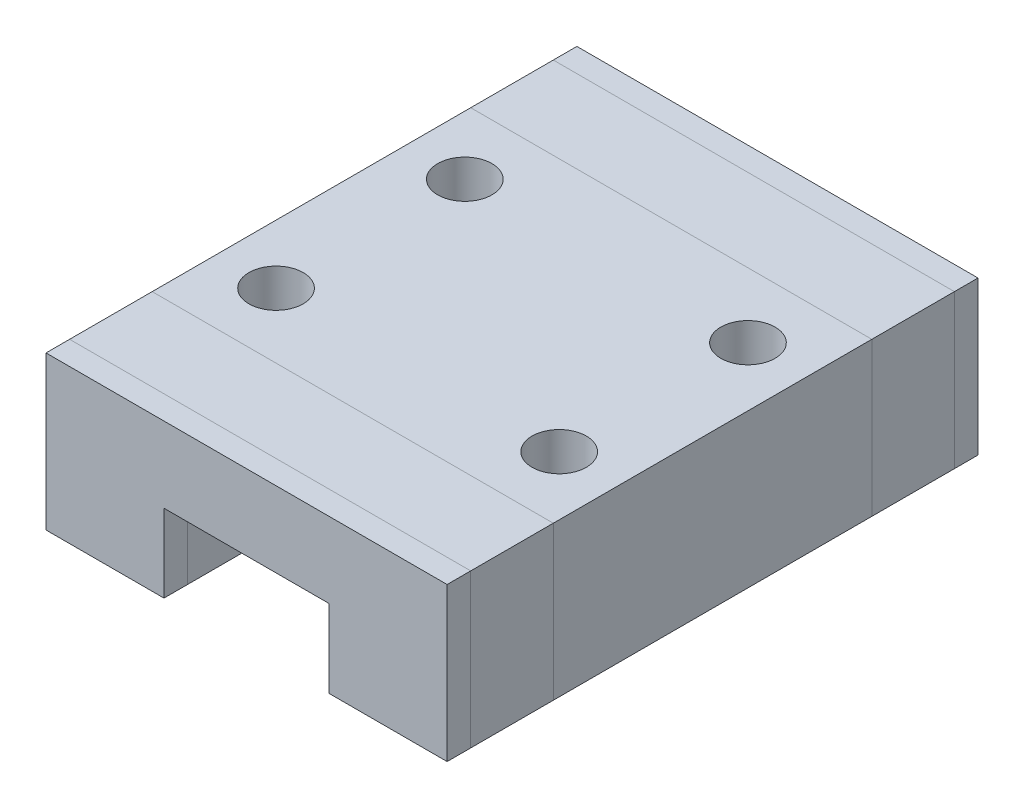
ISO-10303-21;
HEADER;
FILE_DESCRIPTION(('STEP AP214'),'2;1');
FILE_NAME('part.step','',(''),(''),'','','');
FILE_SCHEMA(('AUTOMOTIVE_DESIGN { 1 0 10303 214 1 1 1 1 }'));
ENDSEC;
DATA;
#1=APPLICATION_CONTEXT('core data for automotive mechanical design processes');
#2=APPLICATION_PROTOCOL_DEFINITION('international standard','automotive_design',2000,#1);
#3=PRODUCT_CONTEXT('',#1,'mechanical');
#4=PRODUCT('Part','Part','',(#3));
#5=PRODUCT_RELATED_PRODUCT_CATEGORY('part','',(#4));
#6=PRODUCT_DEFINITION_FORMATION('','',#4);
#7=PRODUCT_DEFINITION_CONTEXT('part definition',#1,'design');
#8=PRODUCT_DEFINITION('design','',#6,#7);
#9=PRODUCT_DEFINITION_SHAPE('','',#8);
#10=(LENGTH_UNIT() NAMED_UNIT(*) SI_UNIT(.MILLI.,.METRE.));
#11=(NAMED_UNIT(*) PLANE_ANGLE_UNIT() SI_UNIT($,.RADIAN.));
#12=(NAMED_UNIT(*) SI_UNIT($,.STERADIAN.) SOLID_ANGLE_UNIT());
#13=UNCERTAINTY_MEASURE_WITH_UNIT(LENGTH_MEASURE(1.E-05),#10,'distance_accuracy_value','');
#14=(GEOMETRIC_REPRESENTATION_CONTEXT(3) GLOBAL_UNCERTAINTY_ASSIGNED_CONTEXT((#13)) GLOBAL_UNIT_ASSIGNED_CONTEXT((#10,
#11,#12)) REPRESENTATION_CONTEXT('',''));
#15=CARTESIAN_POINT('',(0.,0.,0.));
#16=DIRECTION('',(0.,0.,1.));
#17=DIRECTION('',(1.,0.,0.));
#18=AXIS2_PLACEMENT_3D('',#15,#16,#17);
#19=CARTESIAN_POINT('',(-8.5,-3.25,22.5));
#20=DIRECTION('',(0.,1.,0.));
#21=DIRECTION('',(0.,0.,1.));
#22=AXIS2_PLACEMENT_3D('',#19,#20,#21);
#23=PLANE('',#22);
#24=DIRECTION('',(-1.,0.,0.));
#25=VECTOR('',#24,1.);
#26=CARTESIAN_POINT('',(-8.5,-3.25,4.5));
#27=LINE('',#26,#25);
#28=CARTESIAN_POINT('',(-3.5,-3.25,4.5));
#29=VERTEX_POINT('',#28);
#30=CARTESIAN_POINT('',(-8.5,-3.25,4.50000000000001));
#31=VERTEX_POINT('',#30);
#32=EDGE_CURVE('E11',#29,#31,#27,.T.);
#33=ORIENTED_EDGE('',*,*,#32,.F.);
#34=DIRECTION('',(0.,0.,1.));
#35=VECTOR('',#34,1.);
#36=CARTESIAN_POINT('',(-3.5,-3.25,0.));
#37=LINE('',#36,#35);
#38=CARTESIAN_POINT('',(-3.5,-3.25,18.));
#39=VERTEX_POINT('',#38);
#40=EDGE_CURVE('E447',#29,#39,#37,.T.);
#41=ORIENTED_EDGE('',*,*,#40,.T.);
#42=DIRECTION('',(-1.,0.,0.));
#43=VECTOR('',#42,1.);
#44=CARTESIAN_POINT('',(-8.5,-3.25,18.));
#45=LINE('',#44,#43);
#46=CARTESIAN_POINT('',(-8.5,-3.25,18.));
#47=VERTEX_POINT('',#46);
#48=EDGE_CURVE('E269',#39,#47,#45,.T.);
#49=ORIENTED_EDGE('',*,*,#48,.T.);
#50=DIRECTION('',(0.,0.,-1.));
#51=VECTOR('',#50,1.);
#52=CARTESIAN_POINT('',(-8.5,-3.25,22.5));
#53=LINE('',#52,#51);
#54=EDGE_CURVE('E258',#47,#31,#53,.T.);
#55=ORIENTED_EDGE('',*,*,#54,.T.);
#56=EDGE_LOOP('',(#33,#41,#49,#55));
#57=FACE_BOUND('',#56,.T.);
#58=ADVANCED_FACE('F38',(#57),#23,.F.);
#59=CARTESIAN_POINT('',(8.5,-3.25,22.5));
#60=DIRECTION('',(-1.,0.,0.));
#61=DIRECTION('',(0.,0.,1.));
#62=AXIS2_PLACEMENT_3D('',#59,#60,#61);
#63=PLANE('',#62);
#64=DIRECTION('',(0.,-1.,0.));
#65=VECTOR('',#64,1.);
#66=CARTESIAN_POINT('',(8.5,-3.25,4.5));
#67=LINE('',#66,#65);
#68=CARTESIAN_POINT('',(8.5,3.25,4.50000000000001));
#69=VERTEX_POINT('',#68);
#70=CARTESIAN_POINT('',(8.5,-3.25,4.50000000000001));
#71=VERTEX_POINT('',#70);
#72=EDGE_CURVE('E48',#69,#71,#67,.T.);
#73=ORIENTED_EDGE('',*,*,#72,.F.);
#74=DIRECTION('',(0.,0.,-1.));
#75=VECTOR('',#74,1.);
#76=CARTESIAN_POINT('',(8.5,3.25,22.5));
#77=LINE('',#76,#75);
#78=CARTESIAN_POINT('',(8.5,3.25,18.));
#79=VERTEX_POINT('',#78);
#80=EDGE_CURVE('E272',#79,#69,#77,.T.);
#81=ORIENTED_EDGE('',*,*,#80,.F.);
#82=DIRECTION('',(0.,-1.,0.));
#83=VECTOR('',#82,1.);
#84=CARTESIAN_POINT('',(8.5,-3.25,18.));
#85=LINE('',#84,#83);
#86=CARTESIAN_POINT('',(8.5,-3.25,18.));
#87=VERTEX_POINT('',#86);
#88=EDGE_CURVE('E273',#79,#87,#85,.T.);
#89=ORIENTED_EDGE('',*,*,#88,.T.);
#90=DIRECTION('',(0.,0.,-1.));
#91=VECTOR('',#90,1.);
#92=CARTESIAN_POINT('',(8.5,-3.25,22.5));
#93=LINE('',#92,#91);
#94=EDGE_CURVE('E251',#87,#71,#93,.T.);
#95=ORIENTED_EDGE('',*,*,#94,.T.);
#96=EDGE_LOOP('',(#73,#81,#89,#95));
#97=FACE_BOUND('',#96,.T.);
#98=ADVANCED_FACE('F539',(#97),#63,.F.);
#99=CARTESIAN_POINT('',(-8.5,3.25,22.5));
#100=DIRECTION('',(0.,-1.,0.));
#101=DIRECTION('',(0.,0.,-1.));
#102=AXIS2_PLACEMENT_3D('',#99,#100,#101);
#103=PLANE('',#102);
#104=CARTESIAN_POINT('',(6.,3.25,7.25));
#105=DIRECTION('',(0.,1.,0.));
#106=DIRECTION('',(0.,0.,-1.));
#107=AXIS2_PLACEMENT_3D('',#104,#105,#106);
#108=CIRCLE('',#107,1.15);
#109=CARTESIAN_POINT('',(6.,3.25,6.1));
#110=VERTEX_POINT('',#109);
#111=EDGE_CURVE('E508',#110,#110,#108,.T.);
#112=ORIENTED_EDGE('',*,*,#111,.F.);
#113=EDGE_LOOP('',(#112));
#114=FACE_BOUND('',#113,.T.);
#115=CARTESIAN_POINT('',(6.,3.25,15.25));
#116=DIRECTION('',(0.,1.,0.));
#117=DIRECTION('',(0.,0.,1.));
#118=AXIS2_PLACEMENT_3D('',#115,#116,#117);
#119=CIRCLE('',#118,1.15);
#120=CARTESIAN_POINT('',(6.,3.25,16.4));
#121=VERTEX_POINT('',#120);
#122=EDGE_CURVE('E514',#121,#121,#119,.T.);
#123=ORIENTED_EDGE('',*,*,#122,.F.);
#124=EDGE_LOOP('',(#123));
#125=FACE_BOUND('',#124,.T.);
#126=CARTESIAN_POINT('',(-6.,3.25,15.25));
#127=DIRECTION('',(0.,1.,0.));
#128=DIRECTION('',(0.,0.,-1.));
#129=AXIS2_PLACEMENT_3D('',#126,#127,#128);
#130=CIRCLE('',#129,1.15);
#131=CARTESIAN_POINT('',(-6.,3.25,14.1));
#132=VERTEX_POINT('',#131);
#133=EDGE_CURVE('E520',#132,#132,#130,.T.);
#134=ORIENTED_EDGE('',*,*,#133,.F.);
#135=EDGE_LOOP('',(#134));
#136=FACE_BOUND('',#135,.T.);
#137=CARTESIAN_POINT('',(-6.,3.25,7.25));
#138=DIRECTION('',(0.,1.,0.));
#139=DIRECTION('',(0.,0.,1.));
#140=AXIS2_PLACEMENT_3D('',#137,#138,#139);
#141=CIRCLE('',#140,1.15);
#142=CARTESIAN_POINT('',(-6.,3.25,8.4));
#143=VERTEX_POINT('',#142);
#144=EDGE_CURVE('E502',#143,#143,#141,.T.);
#145=ORIENTED_EDGE('',*,*,#144,.F.);
#146=EDGE_LOOP('',(#145));
#147=FACE_BOUND('',#146,.T.);
#148=DIRECTION('',(1.,0.,0.));
#149=VECTOR('',#148,1.);
#150=CARTESIAN_POINT('',(-8.5,3.25,4.5));
#151=LINE('',#150,#149);
#152=CARTESIAN_POINT('',(-8.5,3.25,4.50000000000001));
#153=VERTEX_POINT('',#152);
#154=EDGE_CURVE('E62',#153,#69,#151,.T.);
#155=ORIENTED_EDGE('',*,*,#154,.F.);
#156=DIRECTION('',(0.,0.,-1.));
#157=VECTOR('',#156,1.);
#158=CARTESIAN_POINT('',(-8.5,3.25,22.5));
#159=LINE('',#158,#157);
#160=CARTESIAN_POINT('',(-8.5,3.25,18.));
#161=VERTEX_POINT('',#160);
#162=EDGE_CURVE('E265',#161,#153,#159,.T.);
#163=ORIENTED_EDGE('',*,*,#162,.F.);
#164=DIRECTION('',(1.,0.,0.));
#165=VECTOR('',#164,1.);
#166=CARTESIAN_POINT('',(-8.5,3.25,18.));
#167=LINE('',#166,#165);
#168=EDGE_CURVE('E278',#161,#79,#167,.T.);
#169=ORIENTED_EDGE('',*,*,#168,.T.);
#170=ORIENTED_EDGE('',*,*,#80,.T.);
#171=EDGE_LOOP('',(#155,#163,#169,#170));
#172=FACE_BOUND('',#171,.T.);
#173=ADVANCED_FACE('F535',(#114,#125,#136,#147,#172),#103,.F.);
#174=CARTESIAN_POINT('',(-8.5,-3.25,22.5));
#175=DIRECTION('',(1.,0.,0.));
#176=DIRECTION('',(0.,0.,-1.));
#177=AXIS2_PLACEMENT_3D('',#174,#175,#176);
#178=PLANE('',#177);
#179=DIRECTION('',(0.,1.,0.));
#180=VECTOR('',#179,1.);
#181=CARTESIAN_POINT('',(-8.5,-3.25,4.5));
#182=LINE('',#181,#180);
#183=EDGE_CURVE('E360',#31,#153,#182,.T.);
#184=ORIENTED_EDGE('',*,*,#183,.F.);
#185=ORIENTED_EDGE('',*,*,#54,.F.);
#186=DIRECTION('',(0.,1.,0.));
#187=VECTOR('',#186,1.);
#188=CARTESIAN_POINT('',(-8.5,-3.25,18.));
#189=LINE('',#188,#187);
#190=EDGE_CURVE('E277',#47,#161,#189,.T.);
#191=ORIENTED_EDGE('',*,*,#190,.T.);
#192=ORIENTED_EDGE('',*,*,#162,.T.);
#193=EDGE_LOOP('',(#184,#185,#191,#192));
#194=FACE_BOUND('',#193,.T.);
#195=ADVANCED_FACE('F538',(#194),#178,.F.);
#196=DIRECTION('',(-1.,0.,0.));
#197=VECTOR('',#196,1.);
#198=CARTESIAN_POINT('',(-8.5,-3.25,4.5));
#199=LINE('',#198,#197);
#200=CARTESIAN_POINT('',(3.5,-3.25,4.5));
#201=VERTEX_POINT('',#200);
#202=EDGE_CURVE('E363',#71,#201,#199,.T.);
#203=ORIENTED_EDGE('',*,*,#202,.F.);
#204=ORIENTED_EDGE('',*,*,#94,.F.);
#205=DIRECTION('',(-1.,0.,0.));
#206=VECTOR('',#205,1.);
#207=CARTESIAN_POINT('',(-8.5,-3.25,18.));
#208=LINE('',#207,#206);
#209=CARTESIAN_POINT('',(3.5,-3.25,18.));
#210=VERTEX_POINT('',#209);
#211=EDGE_CURVE('E286',#87,#210,#208,.T.);
#212=ORIENTED_EDGE('',*,*,#211,.T.);
#213=DIRECTION('',(0.,0.,1.));
#214=VECTOR('',#213,1.);
#215=CARTESIAN_POINT('',(3.5,-3.25,0.));
#216=LINE('',#215,#214);
#217=EDGE_CURVE('E228',#201,#210,#216,.T.);
#218=ORIENTED_EDGE('',*,*,#217,.F.);
#219=EDGE_LOOP('',(#203,#204,#212,#218));
#220=FACE_BOUND('',#219,.T.);
#221=ADVANCED_FACE('F562',(#220),#23,.F.);
#222=CARTESIAN_POINT('',(-3.5,-3.25,0.));
#223=DIRECTION('',(-1.,0.,0.));
#224=DIRECTION('',(0.,0.,1.));
#225=AXIS2_PLACEMENT_3D('',#222,#223,#224);
#226=PLANE('',#225);
#227=DIRECTION('',(0.,-1.,0.));
#228=VECTOR('',#227,1.);
#229=CARTESIAN_POINT('',(-3.5,-3.25,4.5));
#230=LINE('',#229,#228);
#231=CARTESIAN_POINT('',(-3.5,0.0500000000000001,4.5));
#232=VERTEX_POINT('',#231);
#233=EDGE_CURVE('E370',#232,#29,#230,.T.);
#234=ORIENTED_EDGE('',*,*,#233,.F.);
#235=DIRECTION('',(0.,0.,1.));
#236=VECTOR('',#235,1.);
#237=CARTESIAN_POINT('',(-3.5,0.0500000000000001,0.));
#238=LINE('',#237,#236);
#239=CARTESIAN_POINT('',(-3.5,0.0500000000000001,18.));
#240=VERTEX_POINT('',#239);
#241=EDGE_CURVE('E453',#232,#240,#238,.T.);
#242=ORIENTED_EDGE('',*,*,#241,.T.);
#243=DIRECTION('',(0.,-1.,0.));
#244=VECTOR('',#243,1.);
#245=CARTESIAN_POINT('',(-3.5,-3.25,18.));
#246=LINE('',#245,#244);
#247=EDGE_CURVE('E282',#240,#39,#246,.T.);
#248=ORIENTED_EDGE('',*,*,#247,.T.);
#249=ORIENTED_EDGE('',*,*,#40,.F.);
#250=EDGE_LOOP('',(#234,#242,#248,#249));
#251=FACE_BOUND('',#250,.T.);
#252=ADVANCED_FACE('F570',(#251),#226,.F.);
#253=CARTESIAN_POINT('',(-3.5,0.0500000000000001,0.));
#254=DIRECTION('',(0.,1.,0.));
#255=DIRECTION('',(-1.,0.,0.));
#256=AXIS2_PLACEMENT_3D('',#253,#254,#255);
#257=PLANE('',#256);
#258=DIRECTION('',(-1.,0.,0.));
#259=VECTOR('',#258,1.);
#260=CARTESIAN_POINT('',(-3.5,0.0500000000000001,4.5));
#261=LINE('',#260,#259);
#262=CARTESIAN_POINT('',(3.5,0.050000000000001,4.5));
#263=VERTEX_POINT('',#262);
#264=EDGE_CURVE('E373',#263,#232,#261,.T.);
#265=ORIENTED_EDGE('',*,*,#264,.F.);
#266=DIRECTION('',(0.,0.,1.));
#267=VECTOR('',#266,1.);
#268=CARTESIAN_POINT('',(3.5,0.050000000000001,0.));
#269=LINE('',#268,#267);
#270=CARTESIAN_POINT('',(3.5,0.050000000000001,18.));
#271=VERTEX_POINT('',#270);
#272=EDGE_CURVE('E396',#263,#271,#269,.T.);
#273=ORIENTED_EDGE('',*,*,#272,.T.);
#274=DIRECTION('',(-1.,0.,0.));
#275=VECTOR('',#274,1.);
#276=CARTESIAN_POINT('',(-3.5,0.0500000000000001,18.));
#277=LINE('',#276,#275);
#278=EDGE_CURVE('E295',#271,#240,#277,.T.);
#279=ORIENTED_EDGE('',*,*,#278,.T.);
#280=ORIENTED_EDGE('',*,*,#241,.F.);
#281=EDGE_LOOP('',(#265,#273,#279,#280));
#282=FACE_BOUND('',#281,.T.);
#283=ADVANCED_FACE('F627',(#282),#257,.F.);
#284=CARTESIAN_POINT('',(3.5,0.050000000000001,0.));
#285=DIRECTION('',(1.,0.,0.));
#286=DIRECTION('',(0.,1.,0.));
#287=AXIS2_PLACEMENT_3D('',#284,#285,#286);
#288=PLANE('',#287);
#289=DIRECTION('',(0.,1.,0.));
#290=VECTOR('',#289,1.);
#291=CARTESIAN_POINT('',(3.5,0.050000000000001,4.5));
#292=LINE('',#291,#290);
#293=EDGE_CURVE('E42',#201,#263,#292,.T.);
#294=ORIENTED_EDGE('',*,*,#293,.F.);
#295=ORIENTED_EDGE('',*,*,#217,.T.);
#296=DIRECTION('',(0.,1.,0.));
#297=VECTOR('',#296,1.);
#298=CARTESIAN_POINT('',(3.5,0.050000000000001,18.));
#299=LINE('',#298,#297);
#300=EDGE_CURVE('E290',#210,#271,#299,.T.);
#301=ORIENTED_EDGE('',*,*,#300,.T.);
#302=ORIENTED_EDGE('',*,*,#272,.F.);
#303=EDGE_LOOP('',(#294,#295,#301,#302));
#304=FACE_BOUND('',#303,.T.);
#305=ADVANCED_FACE('F397',(#304),#288,.F.);
#306=CARTESIAN_POINT('',(-3.5,-3.25,1.));
#307=VERTEX_POINT('',#306);
#308=EDGE_CURVE('E446',#307,#29,#37,.T.);
#309=ORIENTED_EDGE('',*,*,#308,.T.);
#310=ORIENTED_EDGE('',*,*,#32,.T.);
#311=CARTESIAN_POINT('',(-8.5,-3.25,1.00000000000001));
#312=VERTEX_POINT('',#311);
#313=EDGE_CURVE('E257',#31,#312,#53,.T.);
#314=ORIENTED_EDGE('',*,*,#313,.T.);
#315=DIRECTION('',(-1.,0.,0.));
#316=VECTOR('',#315,1.);
#317=CARTESIAN_POINT('',(-8.5,-3.25,1.));
#318=LINE('',#317,#316);
#319=EDGE_CURVE('E341',#307,#312,#318,.T.);
#320=ORIENTED_EDGE('',*,*,#319,.F.);
#321=EDGE_LOOP('',(#309,#310,#314,#320));
#322=FACE_BOUND('',#321,.T.);
#323=ADVANCED_FACE('F485',(#322),#23,.F.);
#324=CARTESIAN_POINT('',(8.5,3.25,1.00000000000001));
#325=VERTEX_POINT('',#324);
#326=EDGE_CURVE('E271',#69,#325,#77,.T.);
#327=ORIENTED_EDGE('',*,*,#326,.F.);
#328=ORIENTED_EDGE('',*,*,#72,.T.);
#329=CARTESIAN_POINT('',(8.5,-3.25,1.00000000000001));
#330=VERTEX_POINT('',#329);
#331=EDGE_CURVE('E250',#71,#330,#93,.T.);
#332=ORIENTED_EDGE('',*,*,#331,.T.);
#333=DIRECTION('',(0.,-1.,0.));
#334=VECTOR('',#333,1.);
#335=CARTESIAN_POINT('',(8.5,-3.25,1.));
#336=LINE('',#335,#334);
#337=EDGE_CURVE('E337',#325,#330,#336,.T.);
#338=ORIENTED_EDGE('',*,*,#337,.F.);
#339=EDGE_LOOP('',(#327,#328,#332,#338));
#340=FACE_BOUND('',#339,.T.);
#341=ADVANCED_FACE('F566',(#340),#63,.F.);
#342=CARTESIAN_POINT('',(-8.5,3.25,1.00000000000001));
#343=VERTEX_POINT('',#342);
#344=EDGE_CURVE('E264',#153,#343,#159,.T.);
#345=ORIENTED_EDGE('',*,*,#344,.F.);
#346=ORIENTED_EDGE('',*,*,#154,.T.);
#347=ORIENTED_EDGE('',*,*,#326,.T.);
#348=DIRECTION('',(1.,0.,0.));
#349=VECTOR('',#348,1.);
#350=CARTESIAN_POINT('',(-8.5,3.25,1.));
#351=LINE('',#350,#349);
#352=EDGE_CURVE('E336',#343,#325,#351,.T.);
#353=ORIENTED_EDGE('',*,*,#352,.F.);
#354=EDGE_LOOP('',(#345,#346,#347,#353));
#355=FACE_BOUND('',#354,.T.);
#356=ADVANCED_FACE('F541',(#355),#103,.F.);
#357=ORIENTED_EDGE('',*,*,#313,.F.);
#358=ORIENTED_EDGE('',*,*,#183,.T.);
#359=ORIENTED_EDGE('',*,*,#344,.T.);
#360=DIRECTION('',(0.,1.,0.));
#361=VECTOR('',#360,1.);
#362=CARTESIAN_POINT('',(-8.5,-3.25,1.));
#363=LINE('',#362,#361);
#364=EDGE_CURVE('E332',#312,#343,#363,.T.);
#365=ORIENTED_EDGE('',*,*,#364,.F.);
#366=EDGE_LOOP('',(#357,#358,#359,#365));
#367=FACE_BOUND('',#366,.T.);
#368=ADVANCED_FACE('F490',(#367),#178,.F.);
#369=ORIENTED_EDGE('',*,*,#331,.F.);
#370=ORIENTED_EDGE('',*,*,#202,.T.);
#371=CARTESIAN_POINT('',(3.5,-3.25,1.));
#372=VERTEX_POINT('',#371);
#373=EDGE_CURVE('E226',#372,#201,#216,.T.);
#374=ORIENTED_EDGE('',*,*,#373,.F.);
#375=DIRECTION('',(-1.,0.,0.));
#376=VECTOR('',#375,1.);
#377=CARTESIAN_POINT('',(-8.5,-3.25,1.));
#378=LINE('',#377,#376);
#379=EDGE_CURVE('E223',#330,#372,#378,.T.);
#380=ORIENTED_EDGE('',*,*,#379,.F.);
#381=EDGE_LOOP('',(#369,#370,#374,#380));
#382=FACE_BOUND('',#381,.T.);
#383=ADVANCED_FACE('F604',(#382),#23,.F.);
#384=CARTESIAN_POINT('',(-3.5,0.0500000000000001,1.));
#385=VERTEX_POINT('',#384);
#386=EDGE_CURVE('E452',#385,#232,#238,.T.);
#387=ORIENTED_EDGE('',*,*,#386,.T.);
#388=ORIENTED_EDGE('',*,*,#233,.T.);
#389=ORIENTED_EDGE('',*,*,#308,.F.);
#390=DIRECTION('',(0.,-1.,0.));
#391=VECTOR('',#390,1.);
#392=CARTESIAN_POINT('',(-3.5,-3.25,1.));
#393=LINE('',#392,#391);
#394=EDGE_CURVE('E350',#385,#307,#393,.T.);
#395=ORIENTED_EDGE('',*,*,#394,.F.);
#396=EDGE_LOOP('',(#387,#388,#389,#395));
#397=FACE_BOUND('',#396,.T.);
#398=ADVANCED_FACE('F612',(#397),#226,.F.);
#399=CARTESIAN_POINT('',(3.5,0.050000000000001,1.));
#400=VERTEX_POINT('',#399);
#401=EDGE_CURVE('E392',#400,#263,#269,.T.);
#402=ORIENTED_EDGE('',*,*,#401,.T.);
#403=ORIENTED_EDGE('',*,*,#264,.T.);
#404=ORIENTED_EDGE('',*,*,#386,.F.);
#405=DIRECTION('',(-1.,0.,0.));
#406=VECTOR('',#405,1.);
#407=CARTESIAN_POINT('',(-3.5,0.0500000000000001,1.));
#408=LINE('',#407,#406);
#409=EDGE_CURVE('E354',#400,#385,#408,.T.);
#410=ORIENTED_EDGE('',*,*,#409,.F.);
#411=EDGE_LOOP('',(#402,#403,#404,#410));
#412=FACE_BOUND('',#411,.T.);
#413=ADVANCED_FACE('F403',(#412),#257,.F.);
#414=ORIENTED_EDGE('',*,*,#373,.T.);
#415=ORIENTED_EDGE('',*,*,#293,.T.);
#416=ORIENTED_EDGE('',*,*,#401,.F.);
#417=DIRECTION('',(0.,1.,0.));
#418=VECTOR('',#417,1.);
#419=CARTESIAN_POINT('',(3.5,0.050000000000001,1.));
#420=LINE('',#419,#418);
#421=EDGE_CURVE('E323',#372,#400,#420,.T.);
#422=ORIENTED_EDGE('',*,*,#421,.F.);
#423=EDGE_LOOP('',(#414,#415,#416,#422));
#424=FACE_BOUND('',#423,.T.);
#425=ADVANCED_FACE('F391',(#424),#288,.F.);
#426=DIRECTION('',(0.,1.,0.));
#427=VECTOR('',#426,1.);
#428=CARTESIAN_POINT('',(3.5,0.050000000000001,21.5));
#429=LINE('',#428,#427);
#430=CARTESIAN_POINT('',(3.5,-3.25,21.5));
#431=VERTEX_POINT('',#430);
#432=CARTESIAN_POINT('',(3.5,0.050000000000001,21.5));
#433=VERTEX_POINT('',#432);
#434=EDGE_CURVE('E320',#431,#433,#429,.T.);
#435=ORIENTED_EDGE('',*,*,#434,.F.);
#436=CARTESIAN_POINT('',(3.5,-3.25,22.5));
#437=VERTEX_POINT('',#436);
#438=EDGE_CURVE('E430',#431,#437,#216,.T.);
#439=ORIENTED_EDGE('',*,*,#438,.T.);
#440=DIRECTION('',(0.,1.,0.));
#441=VECTOR('',#440,1.);
#442=CARTESIAN_POINT('',(3.5,0.050000000000001,22.5));
#443=LINE('',#442,#441);
#444=CARTESIAN_POINT('',(3.5,0.050000000000001,22.5));
#445=VERTEX_POINT('',#444);
#446=EDGE_CURVE('E427',#437,#445,#443,.T.);
#447=ORIENTED_EDGE('',*,*,#446,.T.);
#448=EDGE_CURVE('E225',#433,#445,#269,.T.);
#449=ORIENTED_EDGE('',*,*,#448,.F.);
#450=EDGE_LOOP('',(#435,#439,#447,#449));
#451=FACE_BOUND('',#450,.T.);
#452=ADVANCED_FACE('F425',(#451),#288,.F.);
#453=DIRECTION('',(-1.,0.,0.));
#454=VECTOR('',#453,1.);
#455=CARTESIAN_POINT('',(-3.5,0.0500000000000001,21.5));
#456=LINE('',#455,#454);
#457=CARTESIAN_POINT('',(-3.5,0.0500000000000001,21.5));
#458=VERTEX_POINT('',#457);
#459=EDGE_CURVE('E324',#433,#458,#456,.T.);
#460=ORIENTED_EDGE('',*,*,#459,.F.);
#461=ORIENTED_EDGE('',*,*,#448,.T.);
#462=DIRECTION('',(-1.,0.,0.));
#463=VECTOR('',#462,1.);
#464=CARTESIAN_POINT('',(-3.5,0.0500000000000001,22.5));
#465=LINE('',#464,#463);
#466=CARTESIAN_POINT('',(-3.5,0.0500000000000001,22.5));
#467=VERTEX_POINT('',#466);
#468=EDGE_CURVE('E433',#445,#467,#465,.T.);
#469=ORIENTED_EDGE('',*,*,#468,.T.);
#470=EDGE_CURVE('E404',#458,#467,#238,.T.);
#471=ORIENTED_EDGE('',*,*,#470,.F.);
#472=EDGE_LOOP('',(#460,#461,#469,#471));
#473=FACE_BOUND('',#472,.T.);
#474=ADVANCED_FACE('F423',(#473),#257,.F.);
#475=DIRECTION('',(0.,-1.,0.));
#476=VECTOR('',#475,1.);
#477=CARTESIAN_POINT('',(-3.5,-3.25,21.5));
#478=LINE('',#477,#476);
#479=CARTESIAN_POINT('',(-3.5,-3.25,21.5));
#480=VERTEX_POINT('',#479);
#481=EDGE_CURVE('E312',#458,#480,#478,.T.);
#482=ORIENTED_EDGE('',*,*,#481,.F.);
#483=ORIENTED_EDGE('',*,*,#470,.T.);
#484=DIRECTION('',(0.,-1.,0.));
#485=VECTOR('',#484,1.);
#486=CARTESIAN_POINT('',(-3.5,-3.25,22.5));
#487=LINE('',#486,#485);
#488=CARTESIAN_POINT('',(-3.5,-3.25,22.5));
#489=VERTEX_POINT('',#488);
#490=EDGE_CURVE('E214',#467,#489,#487,.T.);
#491=ORIENTED_EDGE('',*,*,#490,.T.);
#492=EDGE_CURVE('E451',#480,#489,#37,.T.);
#493=ORIENTED_EDGE('',*,*,#492,.F.);
#494=EDGE_LOOP('',(#482,#483,#491,#493));
#495=FACE_BOUND('',#494,.T.);
#496=ADVANCED_FACE('F461',(#495),#226,.F.);
#497=DIRECTION('',(0.,1.,0.));
#498=VECTOR('',#497,1.);
#499=CARTESIAN_POINT('',(-8.5,-3.25,21.5));
#500=LINE('',#499,#498);
#501=CARTESIAN_POINT('',(-8.5,-3.25,21.5));
#502=VERTEX_POINT('',#501);
#503=CARTESIAN_POINT('',(-8.5,3.25,21.5));
#504=VERTEX_POINT('',#503);
#505=EDGE_CURVE('E308',#502,#504,#500,.T.);
#506=ORIENTED_EDGE('',*,*,#505,.F.);
#507=CARTESIAN_POINT('',(-8.5,-3.25,22.5));
#508=VERTEX_POINT('',#507);
#509=EDGE_CURVE('E252',#508,#502,#53,.T.);
#510=ORIENTED_EDGE('',*,*,#509,.F.);
#511=DIRECTION('',(0.,-1.,0.));
#512=VECTOR('',#511,1.);
#513=CARTESIAN_POINT('',(-8.5,-3.25,22.5));
#514=LINE('',#513,#512);
#515=CARTESIAN_POINT('',(-8.5,3.25,22.5));
#516=VERTEX_POINT('',#515);
#517=EDGE_CURVE('E1071',#516,#508,#514,.T.);
#518=ORIENTED_EDGE('',*,*,#517,.F.);
#519=EDGE_CURVE('E259',#516,#504,#159,.T.);
#520=ORIENTED_EDGE('',*,*,#519,.T.);
#521=EDGE_LOOP('',(#506,#510,#518,#520));
#522=FACE_BOUND('',#521,.T.);
#523=ADVANCED_FACE('F619',(#522),#178,.F.);
#524=DIRECTION('',(0.,-1.,0.));
#525=VECTOR('',#524,1.);
#526=CARTESIAN_POINT('',(8.5,-3.25,21.5));
#527=LINE('',#526,#525);
#528=CARTESIAN_POINT('',(8.5,3.25,21.5));
#529=VERTEX_POINT('',#528);
#530=CARTESIAN_POINT('',(8.5,-3.25,21.5));
#531=VERTEX_POINT('',#530);
#532=EDGE_CURVE('E305',#529,#531,#527,.T.);
#533=ORIENTED_EDGE('',*,*,#532,.F.);
#534=CARTESIAN_POINT('',(8.5,3.25,22.5));
#535=VERTEX_POINT('',#534);
#536=EDGE_CURVE('E266',#535,#529,#77,.T.);
#537=ORIENTED_EDGE('',*,*,#536,.F.);
#538=DIRECTION('',(0.,1.,0.));
#539=VECTOR('',#538,1.);
#540=CARTESIAN_POINT('',(8.5,-3.25,22.5));
#541=LINE('',#540,#539);
#542=CARTESIAN_POINT('',(8.5,-3.25,22.5));
#543=VERTEX_POINT('',#542);
#544=EDGE_CURVE('E239',#543,#535,#541,.T.);
#545=ORIENTED_EDGE('',*,*,#544,.F.);
#546=EDGE_CURVE('E245',#543,#531,#93,.T.);
#547=ORIENTED_EDGE('',*,*,#546,.T.);
#548=EDGE_LOOP('',(#533,#537,#545,#547));
#549=FACE_BOUND('',#548,.T.);
#550=ADVANCED_FACE('F608',(#549),#63,.F.);
#551=DIRECTION('',(1.,0.,0.));
#552=VECTOR('',#551,1.);
#553=CARTESIAN_POINT('',(-8.5,3.25,21.5));
#554=LINE('',#553,#552);
#555=EDGE_CURVE('E309',#504,#529,#554,.T.);
#556=ORIENTED_EDGE('',*,*,#555,.F.);
#557=ORIENTED_EDGE('',*,*,#519,.F.);
#558=DIRECTION('',(-1.,0.,0.));
#559=VECTOR('',#558,1.);
#560=CARTESIAN_POINT('',(-8.5,3.25,22.5));
#561=LINE('',#560,#559);
#562=EDGE_CURVE('E1073',#535,#516,#561,.T.);
#563=ORIENTED_EDGE('',*,*,#562,.F.);
#564=ORIENTED_EDGE('',*,*,#536,.T.);
#565=EDGE_LOOP('',(#556,#557,#563,#564));
#566=FACE_BOUND('',#565,.T.);
#567=ADVANCED_FACE('F595',(#566),#103,.F.);
#568=DIRECTION('',(-1.,0.,0.));
#569=VECTOR('',#568,1.);
#570=CARTESIAN_POINT('',(-8.5,-3.25,21.5));
#571=LINE('',#570,#569);
#572=EDGE_CURVE('E316',#531,#431,#571,.T.);
#573=ORIENTED_EDGE('',*,*,#572,.F.);
#574=ORIENTED_EDGE('',*,*,#546,.F.);
#575=DIRECTION('',(1.,0.,0.));
#576=VECTOR('',#575,1.);
#577=CARTESIAN_POINT('',(-8.5,-3.25,22.5));
#578=LINE('',#577,#576);
#579=EDGE_CURVE('E1070',#437,#543,#578,.T.);
#580=ORIENTED_EDGE('',*,*,#579,.F.);
#581=ORIENTED_EDGE('',*,*,#438,.F.);
#582=EDGE_LOOP('',(#573,#574,#580,#581));
#583=FACE_BOUND('',#582,.T.);
#584=ADVANCED_FACE('F598',(#583),#23,.F.);
#585=DIRECTION('',(-1.,0.,0.));
#586=VECTOR('',#585,1.);
#587=CARTESIAN_POINT('',(-8.5,-3.25,21.5));
#588=LINE('',#587,#586);
#589=EDGE_CURVE('E294',#480,#502,#588,.T.);
#590=ORIENTED_EDGE('',*,*,#589,.F.);
#591=ORIENTED_EDGE('',*,*,#492,.T.);
#592=EDGE_CURVE('E1068',#508,#489,#578,.T.);
#593=ORIENTED_EDGE('',*,*,#592,.F.);
#594=ORIENTED_EDGE('',*,*,#509,.T.);
#595=EDGE_LOOP('',(#590,#591,#593,#594));
#596=FACE_BOUND('',#595,.T.);
#597=ADVANCED_FACE('F468',(#596),#23,.F.);
#598=EDGE_CURVE('E229',#210,#431,#216,.T.);
#599=ORIENTED_EDGE('',*,*,#598,.T.);
#600=ORIENTED_EDGE('',*,*,#434,.T.);
#601=EDGE_CURVE('E401',#271,#433,#269,.T.);
#602=ORIENTED_EDGE('',*,*,#601,.F.);
#603=ORIENTED_EDGE('',*,*,#300,.F.);
#604=EDGE_LOOP('',(#599,#600,#602,#603));
#605=FACE_BOUND('',#604,.T.);
#606=ADVANCED_FACE('F419',(#605),#288,.F.);
#607=ORIENTED_EDGE('',*,*,#601,.T.);
#608=ORIENTED_EDGE('',*,*,#459,.T.);
#609=EDGE_CURVE('E454',#240,#458,#238,.T.);
#610=ORIENTED_EDGE('',*,*,#609,.F.);
#611=ORIENTED_EDGE('',*,*,#278,.F.);
#612=EDGE_LOOP('',(#607,#608,#610,#611));
#613=FACE_BOUND('',#612,.T.);
#614=ADVANCED_FACE('F414',(#613),#257,.F.);
#615=ORIENTED_EDGE('',*,*,#609,.T.);
#616=ORIENTED_EDGE('',*,*,#481,.T.);
#617=EDGE_CURVE('E448',#39,#480,#37,.T.);
#618=ORIENTED_EDGE('',*,*,#617,.F.);
#619=ORIENTED_EDGE('',*,*,#247,.F.);
#620=EDGE_LOOP('',(#615,#616,#618,#619));
#621=FACE_BOUND('',#620,.T.);
#622=ADVANCED_FACE('F466',(#621),#226,.F.);
#623=EDGE_CURVE('E256',#502,#47,#53,.T.);
#624=ORIENTED_EDGE('',*,*,#623,.F.);
#625=ORIENTED_EDGE('',*,*,#505,.T.);
#626=EDGE_CURVE('E263',#504,#161,#159,.T.);
#627=ORIENTED_EDGE('',*,*,#626,.T.);
#628=ORIENTED_EDGE('',*,*,#190,.F.);
#629=EDGE_LOOP('',(#624,#625,#627,#628));
#630=FACE_BOUND('',#629,.T.);
#631=ADVANCED_FACE('F477',(#630),#178,.F.);
#632=EDGE_CURVE('E270',#529,#79,#77,.T.);
#633=ORIENTED_EDGE('',*,*,#632,.F.);
#634=ORIENTED_EDGE('',*,*,#532,.T.);
#635=EDGE_CURVE('E249',#531,#87,#93,.T.);
#636=ORIENTED_EDGE('',*,*,#635,.T.);
#637=ORIENTED_EDGE('',*,*,#88,.F.);
#638=EDGE_LOOP('',(#633,#634,#636,#637));
#639=FACE_BOUND('',#638,.T.);
#640=ADVANCED_FACE('F584',(#639),#63,.F.);
#641=ORIENTED_EDGE('',*,*,#626,.F.);
#642=ORIENTED_EDGE('',*,*,#555,.T.);
#643=ORIENTED_EDGE('',*,*,#632,.T.);
#644=ORIENTED_EDGE('',*,*,#168,.F.);
#645=EDGE_LOOP('',(#641,#642,#643,#644));
#646=FACE_BOUND('',#645,.T.);
#647=ADVANCED_FACE('F589',(#646),#103,.F.);
#648=ORIENTED_EDGE('',*,*,#635,.F.);
#649=ORIENTED_EDGE('',*,*,#572,.T.);
#650=ORIENTED_EDGE('',*,*,#598,.F.);
#651=ORIENTED_EDGE('',*,*,#211,.F.);
#652=EDGE_LOOP('',(#648,#649,#650,#651));
#653=FACE_BOUND('',#652,.T.);
#654=ADVANCED_FACE('F585',(#653),#23,.F.);
#655=ORIENTED_EDGE('',*,*,#617,.T.);
#656=ORIENTED_EDGE('',*,*,#589,.T.);
#657=ORIENTED_EDGE('',*,*,#623,.T.);
#658=ORIENTED_EDGE('',*,*,#48,.F.);
#659=EDGE_LOOP('',(#655,#656,#657,#658));
#660=FACE_BOUND('',#659,.T.);
#661=ADVANCED_FACE('F473',(#660),#23,.F.);
#662=CARTESIAN_POINT('',(-3.5,-3.25,0.));
#663=VERTEX_POINT('',#662);
#664=EDGE_CURVE('E444',#663,#307,#37,.T.);
#665=ORIENTED_EDGE('',*,*,#664,.T.);
#666=ORIENTED_EDGE('',*,*,#319,.T.);
#667=CARTESIAN_POINT('',(-8.5,-3.25,0.));
#668=VERTEX_POINT('',#667);
#669=EDGE_CURVE('E248',#312,#668,#53,.T.);
#670=ORIENTED_EDGE('',*,*,#669,.T.);
#671=DIRECTION('',(1.,0.,0.));
#672=VECTOR('',#671,1.);
#673=CARTESIAN_POINT('',(-8.5,-3.25,0.));
#674=LINE('',#673,#672);
#675=EDGE_CURVE('E235',#668,#663,#674,.T.);
#676=ORIENTED_EDGE('',*,*,#675,.T.);
#677=EDGE_LOOP('',(#665,#666,#670,#676));
#678=FACE_BOUND('',#677,.T.);
#679=ADVANCED_FACE('F489',(#678),#23,.F.);
#680=CARTESIAN_POINT('',(8.5,3.25,0.));
#681=VERTEX_POINT('',#680);
#682=EDGE_CURVE('E262',#325,#681,#77,.T.);
#683=ORIENTED_EDGE('',*,*,#682,.F.);
#684=ORIENTED_EDGE('',*,*,#337,.T.);
#685=CARTESIAN_POINT('',(8.5,-3.25,0.));
#686=VERTEX_POINT('',#685);
#687=EDGE_CURVE('E1065',#330,#686,#93,.T.);
#688=ORIENTED_EDGE('',*,*,#687,.T.);
#689=DIRECTION('',(0.,1.,0.));
#690=VECTOR('',#689,1.);
#691=CARTESIAN_POINT('',(8.5,-3.25,0.));
#692=LINE('',#691,#690);
#693=EDGE_CURVE('E234',#686,#681,#692,.T.);
#694=ORIENTED_EDGE('',*,*,#693,.T.);
#695=EDGE_LOOP('',(#683,#684,#688,#694));
#696=FACE_BOUND('',#695,.T.);
#697=ADVANCED_FACE('F40',(#696),#63,.F.);
#698=CARTESIAN_POINT('',(-8.5,3.25,0.));
#699=VERTEX_POINT('',#698);
#700=EDGE_CURVE('E255',#343,#699,#159,.T.);
#701=ORIENTED_EDGE('',*,*,#700,.F.);
#702=ORIENTED_EDGE('',*,*,#352,.T.);
#703=ORIENTED_EDGE('',*,*,#682,.T.);
#704=DIRECTION('',(-1.,0.,0.));
#705=VECTOR('',#704,1.);
#706=CARTESIAN_POINT('',(-8.5,3.25,0.));
#707=LINE('',#706,#705);
#708=EDGE_CURVE('E241',#681,#699,#707,.T.);
#709=ORIENTED_EDGE('',*,*,#708,.T.);
#710=EDGE_LOOP('',(#701,#702,#703,#709));
#711=FACE_BOUND('',#710,.T.);
#712=ADVANCED_FACE('F542',(#711),#103,.F.);
#713=ORIENTED_EDGE('',*,*,#669,.F.);
#714=ORIENTED_EDGE('',*,*,#364,.T.);
#715=ORIENTED_EDGE('',*,*,#700,.T.);
#716=DIRECTION('',(0.,-1.,0.));
#717=VECTOR('',#716,1.);
#718=CARTESIAN_POINT('',(-8.5,-3.25,0.));
#719=LINE('',#718,#717);
#720=EDGE_CURVE('E236',#699,#668,#719,.T.);
#721=ORIENTED_EDGE('',*,*,#720,.T.);
#722=EDGE_LOOP('',(#713,#714,#715,#721));
#723=FACE_BOUND('',#722,.T.);
#724=ADVANCED_FACE('F495',(#723),#178,.F.);
#725=ORIENTED_EDGE('',*,*,#687,.F.);
#726=ORIENTED_EDGE('',*,*,#379,.T.);
#727=CARTESIAN_POINT('',(3.5,-3.25,0.));
#728=VERTEX_POINT('',#727);
#729=EDGE_CURVE('E207',#728,#372,#216,.T.);
#730=ORIENTED_EDGE('',*,*,#729,.F.);
#731=EDGE_CURVE('E220',#728,#686,#674,.T.);
#732=ORIENTED_EDGE('',*,*,#731,.T.);
#733=EDGE_LOOP('',(#725,#726,#730,#732));
#734=FACE_BOUND('',#733,.T.);
#735=ADVANCED_FACE('F219',(#734),#23,.F.);
#736=CARTESIAN_POINT('',(0.,0.,22.5));
#737=DIRECTION('',(0.,0.,-1.));
#738=DIRECTION('',(-1.,0.,0.));
#739=AXIS2_PLACEMENT_3D('',#736,#737,#738);
#740=PLANE('',#739);
#741=ORIENTED_EDGE('',*,*,#592,.T.);
#742=ORIENTED_EDGE('',*,*,#490,.F.);
#743=ORIENTED_EDGE('',*,*,#468,.F.);
#744=ORIENTED_EDGE('',*,*,#446,.F.);
#745=ORIENTED_EDGE('',*,*,#579,.T.);
#746=ORIENTED_EDGE('',*,*,#544,.T.);
#747=ORIENTED_EDGE('',*,*,#562,.T.);
#748=ORIENTED_EDGE('',*,*,#517,.T.);
#749=EDGE_LOOP('',(#741,#742,#743,#744,#745,#746,#747,#748));
#750=FACE_BOUND('',#749,.T.);
#751=ADVANCED_FACE('F438',(#750),#740,.F.);
#752=CARTESIAN_POINT('',(0.,0.,0.));
#753=DIRECTION('',(0.,0.,-1.));
#754=DIRECTION('',(-1.,0.,0.));
#755=AXIS2_PLACEMENT_3D('',#752,#753,#754);
#756=PLANE('',#755);
#757=DIRECTION('',(0.,-1.,0.));
#758=VECTOR('',#757,1.);
#759=CARTESIAN_POINT('',(-3.5,-3.25,0.));
#760=LINE('',#759,#758);
#761=CARTESIAN_POINT('',(-3.5,0.0500000000000001,0.));
#762=VERTEX_POINT('',#761);
#763=EDGE_CURVE('E499',#762,#663,#760,.T.);
#764=ORIENTED_EDGE('',*,*,#763,.T.);
#765=ORIENTED_EDGE('',*,*,#675,.F.);
#766=ORIENTED_EDGE('',*,*,#720,.F.);
#767=ORIENTED_EDGE('',*,*,#708,.F.);
#768=ORIENTED_EDGE('',*,*,#693,.F.);
#769=ORIENTED_EDGE('',*,*,#731,.F.);
#770=DIRECTION('',(0.,1.,0.));
#771=VECTOR('',#770,1.);
#772=CARTESIAN_POINT('',(3.5,0.050000000000001,0.));
#773=LINE('',#772,#771);
#774=CARTESIAN_POINT('',(3.5,0.050000000000001,0.));
#775=VERTEX_POINT('',#774);
#776=EDGE_CURVE('E203',#728,#775,#773,.T.);
#777=ORIENTED_EDGE('',*,*,#776,.T.);
#778=DIRECTION('',(-1.,0.,0.));
#779=VECTOR('',#778,1.);
#780=CARTESIAN_POINT('',(-3.5,0.0500000000000001,0.));
#781=LINE('',#780,#779);
#782=EDGE_CURVE('E213',#775,#762,#781,.T.);
#783=ORIENTED_EDGE('',*,*,#782,.T.);
#784=EDGE_LOOP('',(#764,#765,#766,#767,#768,#769,#777,#783));
#785=FACE_BOUND('',#784,.T.);
#786=ADVANCED_FACE('F231',(#785),#756,.T.);
#787=EDGE_CURVE('E449',#762,#385,#238,.T.);
#788=ORIENTED_EDGE('',*,*,#787,.T.);
#789=ORIENTED_EDGE('',*,*,#394,.T.);
#790=ORIENTED_EDGE('',*,*,#664,.F.);
#791=ORIENTED_EDGE('',*,*,#763,.F.);
#792=EDGE_LOOP('',(#788,#789,#790,#791));
#793=FACE_BOUND('',#792,.T.);
#794=ADVANCED_FACE('F647',(#793),#226,.F.);
#795=EDGE_CURVE('E209',#775,#400,#269,.T.);
#796=ORIENTED_EDGE('',*,*,#795,.T.);
#797=ORIENTED_EDGE('',*,*,#409,.T.);
#798=ORIENTED_EDGE('',*,*,#787,.F.);
#799=ORIENTED_EDGE('',*,*,#782,.F.);
#800=EDGE_LOOP('',(#796,#797,#798,#799));
#801=FACE_BOUND('',#800,.T.);
#802=ADVANCED_FACE('F555',(#801),#257,.F.);
#803=ORIENTED_EDGE('',*,*,#729,.T.);
#804=ORIENTED_EDGE('',*,*,#421,.T.);
#805=ORIENTED_EDGE('',*,*,#795,.F.);
#806=ORIENTED_EDGE('',*,*,#776,.F.);
#807=EDGE_LOOP('',(#803,#804,#805,#806));
#808=FACE_BOUND('',#807,.T.);
#809=ADVANCED_FACE('F205',(#808),#288,.F.);
#810=CARTESIAN_POINT('',(-6.,-0.75,7.25));
#811=DIRECTION('',(0.,1.,0.));
#812=DIRECTION('',(0.,0.,1.));
#813=AXIS2_PLACEMENT_3D('',#810,#811,#812);
#814=CYLINDRICAL_SURFACE('',#813,1.15);
#815=CARTESIAN_POINT('',(-6.,-0.75,7.25));
#816=DIRECTION('',(0.,1.,0.));
#817=DIRECTION('',(0.,0.,1.));
#818=AXIS2_PLACEMENT_3D('',#815,#816,#817);
#819=CIRCLE('',#818,1.15);
#820=CARTESIAN_POINT('',(-6.,-0.75,8.4));
#821=VERTEX_POINT('',#820);
#822=EDGE_CURVE('E434',#821,#821,#819,.T.);
#823=ORIENTED_EDGE('',*,*,#822,.F.);
#824=EDGE_LOOP('',(#823));
#825=FACE_BOUND('',#824,.T.);
#826=ORIENTED_EDGE('',*,*,#144,.T.);
#827=EDGE_LOOP('',(#826));
#828=FACE_BOUND('',#827,.T.);
#829=ADVANCED_FACE('F545',(#825,#828),#814,.F.);
#830=CARTESIAN_POINT('',(-6.,-0.75,7.25));
#831=DIRECTION('',(0.,1.,0.));
#832=DIRECTION('',(0.,0.,1.));
#833=AXIS2_PLACEMENT_3D('',#830,#831,#832);
#834=PLANE('',#833);
#835=ORIENTED_EDGE('',*,*,#822,.T.);
#836=EDGE_LOOP('',(#835));
#837=FACE_BOUND('',#836,.T.);
#838=ADVANCED_FACE('F531',(#837),#834,.T.);
#839=CARTESIAN_POINT('',(-6.,-0.75,15.25));
#840=DIRECTION('',(0.,1.,0.));
#841=DIRECTION('',(0.,0.,1.));
#842=AXIS2_PLACEMENT_3D('',#839,#840,#841);
#843=CYLINDRICAL_SURFACE('',#842,1.15);
#844=CARTESIAN_POINT('',(-6.,-0.75,15.25));
#845=DIRECTION('',(0.,1.,0.));
#846=DIRECTION('',(0.,0.,-1.));
#847=AXIS2_PLACEMENT_3D('',#844,#845,#846);
#848=CIRCLE('',#847,1.15);
#849=CARTESIAN_POINT('',(-6.,-0.75,14.1));
#850=VERTEX_POINT('',#849);
#851=EDGE_CURVE('E505',#850,#850,#848,.T.);
#852=ORIENTED_EDGE('',*,*,#851,.F.);
#853=EDGE_LOOP('',(#852));
#854=FACE_BOUND('',#853,.T.);
#855=ORIENTED_EDGE('',*,*,#133,.T.);
#856=EDGE_LOOP('',(#855));
#857=FACE_BOUND('',#856,.T.);
#858=ADVANCED_FACE('F528',(#854,#857),#843,.F.);
#859=CARTESIAN_POINT('',(-6.,-0.75,15.25));
#860=DIRECTION('',(0.,-1.,0.));
#861=DIRECTION('',(0.,0.,-1.));
#862=AXIS2_PLACEMENT_3D('',#859,#860,#861);
#863=PLANE('',#862);
#864=ORIENTED_EDGE('',*,*,#851,.T.);
#865=EDGE_LOOP('',(#864));
#866=FACE_BOUND('',#865,.T.);
#867=ADVANCED_FACE('F526',(#866),#863,.F.);
#868=CARTESIAN_POINT('',(6.,-0.75,15.25));
#869=DIRECTION('',(0.,1.,0.));
#870=DIRECTION('',(0.,0.,1.));
#871=AXIS2_PLACEMENT_3D('',#868,#869,#870);
#872=CYLINDRICAL_SURFACE('',#871,1.15);
#873=CARTESIAN_POINT('',(6.,-0.75,15.25));
#874=DIRECTION('',(0.,1.,0.));
#875=DIRECTION('',(0.,0.,1.));
#876=AXIS2_PLACEMENT_3D('',#873,#874,#875);
#877=CIRCLE('',#876,1.15);
#878=CARTESIAN_POINT('',(6.,-0.75,16.4));
#879=VERTEX_POINT('',#878);
#880=EDGE_CURVE('E517',#879,#879,#877,.T.);
#881=ORIENTED_EDGE('',*,*,#880,.F.);
#882=EDGE_LOOP('',(#881));
#883=FACE_BOUND('',#882,.T.);
#884=ORIENTED_EDGE('',*,*,#122,.T.);
#885=EDGE_LOOP('',(#884));
#886=FACE_BOUND('',#885,.T.);
#887=ADVANCED_FACE('F970',(#883,#886),#872,.F.);
#888=CARTESIAN_POINT('',(6.,-0.75,15.25));
#889=DIRECTION('',(0.,1.,0.));
#890=DIRECTION('',(0.,0.,1.));
#891=AXIS2_PLACEMENT_3D('',#888,#889,#890);
#892=PLANE('',#891);
#893=ORIENTED_EDGE('',*,*,#880,.T.);
#894=EDGE_LOOP('',(#893));
#895=FACE_BOUND('',#894,.T.);
#896=ADVANCED_FACE('F978',(#895),#892,.T.);
#897=CARTESIAN_POINT('',(6.,-0.75,7.25));
#898=DIRECTION('',(0.,1.,0.));
#899=DIRECTION('',(0.,0.,1.));
#900=AXIS2_PLACEMENT_3D('',#897,#898,#899);
#901=CYLINDRICAL_SURFACE('',#900,1.15);
#902=CARTESIAN_POINT('',(6.,-0.75,7.25));
#903=DIRECTION('',(0.,1.,0.));
#904=DIRECTION('',(0.,0.,-1.));
#905=AXIS2_PLACEMENT_3D('',#902,#903,#904);
#906=CIRCLE('',#905,1.15);
#907=CARTESIAN_POINT('',(6.,-0.75,6.1));
#908=VERTEX_POINT('',#907);
#909=EDGE_CURVE('E511',#908,#908,#906,.T.);
#910=ORIENTED_EDGE('',*,*,#909,.F.);
#911=EDGE_LOOP('',(#910));
#912=FACE_BOUND('',#911,.T.);
#913=ORIENTED_EDGE('',*,*,#111,.T.);
#914=EDGE_LOOP('',(#913));
#915=FACE_BOUND('',#914,.T.);
#916=ADVANCED_FACE('F987',(#912,#915),#901,.F.);
#917=CARTESIAN_POINT('',(6.,-0.75,7.25));
#918=DIRECTION('',(0.,-1.,0.));
#919=DIRECTION('',(0.,0.,-1.));
#920=AXIS2_PLACEMENT_3D('',#917,#918,#919);
#921=PLANE('',#920);
#922=ORIENTED_EDGE('',*,*,#909,.T.);
#923=EDGE_LOOP('',(#922));
#924=FACE_BOUND('',#923,.T.);
#925=ADVANCED_FACE('F996',(#924),#921,.F.);
#926=CLOSED_SHELL('',(#58,#98,#173,#195,#221,#252,#283,#305,#323,#341,#356,#368,#383,#398,#413,
#425,#452,#474,#496,#523,#550,#567,#584,#597,#606,#614,#622,#631,#640,#647,#654,#661,#679,#697,
#712,#724,#735,#751,#786,#794,#802,#809,#829,#838,#858,#867,#887,#896,#916,#925));
#927=MANIFOLD_SOLID_BREP('B2',#926);
#928=ADVANCED_BREP_SHAPE_REPRESENTATION('',(#18,#927),#14);
#929=SHAPE_DEFINITION_REPRESENTATION(#9,#928);
ENDSEC;
END-ISO-10303-21;
